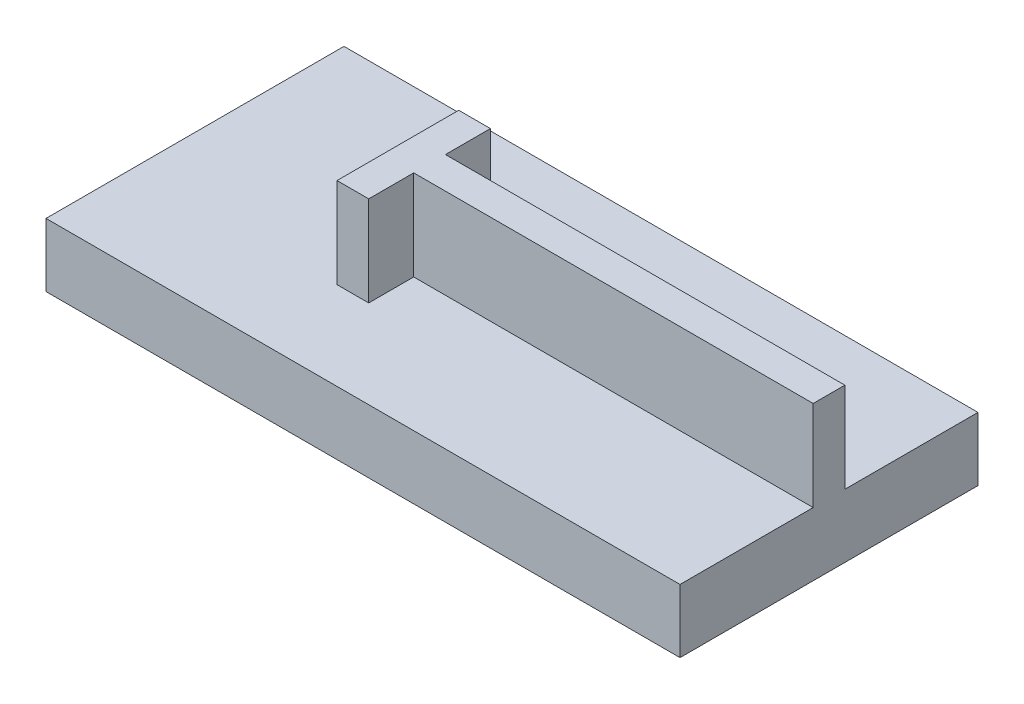
ISO-10303-21;
HEADER;
FILE_DESCRIPTION(('STEP AP214'),'2;1');
FILE_NAME('part.step','',(''),(''),'','','');
FILE_SCHEMA(('AUTOMOTIVE_DESIGN { 1 0 10303 214 1 1 1 1 }'));
ENDSEC;
DATA;
#1=APPLICATION_CONTEXT('core data for automotive mechanical design processes');
#2=APPLICATION_PROTOCOL_DEFINITION('international standard','automotive_design',2000,#1);
#3=PRODUCT_CONTEXT('',#1,'mechanical');
#4=PRODUCT('Part','Part','',(#3));
#5=PRODUCT_RELATED_PRODUCT_CATEGORY('part','',(#4));
#6=PRODUCT_DEFINITION_FORMATION('','',#4);
#7=PRODUCT_DEFINITION_CONTEXT('part definition',#1,'design');
#8=PRODUCT_DEFINITION('design','',#6,#7);
#9=PRODUCT_DEFINITION_SHAPE('','',#8);
#10=(LENGTH_UNIT() NAMED_UNIT(*) SI_UNIT(.MILLI.,.METRE.));
#11=(NAMED_UNIT(*) PLANE_ANGLE_UNIT() SI_UNIT($,.RADIAN.));
#12=(NAMED_UNIT(*) SI_UNIT($,.STERADIAN.) SOLID_ANGLE_UNIT());
#13=UNCERTAINTY_MEASURE_WITH_UNIT(LENGTH_MEASURE(1.E-05),#10,'distance_accuracy_value','');
#14=(GEOMETRIC_REPRESENTATION_CONTEXT(3) GLOBAL_UNCERTAINTY_ASSIGNED_CONTEXT((#13)) GLOBAL_UNIT_ASSIGNED_CONTEXT((#10,
#11,#12)) REPRESENTATION_CONTEXT('',''));
#15=CARTESIAN_POINT('',(0.,0.,0.));
#16=DIRECTION('',(0.,0.,1.));
#17=DIRECTION('',(1.,0.,0.));
#18=AXIS2_PLACEMENT_3D('',#15,#16,#17);
#19=CARTESIAN_POINT('',(0.,10.,0.));
#20=DIRECTION('',(0.,-1.,0.));
#21=DIRECTION('',(0.,0.,-1.));
#22=AXIS2_PLACEMENT_3D('',#19,#20,#21);
#23=PLANE('',#22);
#24=DIRECTION('',(-1.,0.,0.));
#25=VECTOR('',#24,1.);
#26=CARTESIAN_POINT('',(50.,10.,-2.5));
#27=LINE('',#26,#25);
#28=CARTESIAN_POINT('',(50.,10.,-2.5));
#29=VERTEX_POINT('',#28);
#30=CARTESIAN_POINT('',(-13.,10.,-2.49999999999999));
#31=VERTEX_POINT('',#30);
#32=EDGE_CURVE('E240',#29,#31,#27,.T.);
#33=ORIENTED_EDGE('',*,*,#32,.F.);
#34=DIRECTION('',(0.,0.,-1.));
#35=VECTOR('',#34,1.);
#36=CARTESIAN_POINT('',(50.,10.,23.5));
#37=LINE('',#36,#35);
#38=CARTESIAN_POINT('',(50.,10.,-23.5));
#39=VERTEX_POINT('',#38);
#40=EDGE_CURVE('E249',#29,#39,#37,.T.);
#41=ORIENTED_EDGE('',*,*,#40,.T.);
#42=DIRECTION('',(-1.,0.,0.));
#43=VECTOR('',#42,1.);
#44=CARTESIAN_POINT('',(-50.,10.,-23.5));
#45=LINE('',#44,#43);
#46=CARTESIAN_POINT('',(-50.,10.,-23.5));
#47=VERTEX_POINT('',#46);
#48=EDGE_CURVE('E245',#39,#47,#45,.T.);
#49=ORIENTED_EDGE('',*,*,#48,.T.);
#50=DIRECTION('',(0.,0.,1.));
#51=VECTOR('',#50,1.);
#52=CARTESIAN_POINT('',(-50.,10.,23.5));
#53=LINE('',#52,#51);
#54=CARTESIAN_POINT('',(-50.,10.,23.5));
#55=VERTEX_POINT('',#54);
#56=EDGE_CURVE('E271',#47,#55,#53,.T.);
#57=ORIENTED_EDGE('',*,*,#56,.T.);
#58=DIRECTION('',(1.,0.,0.));
#59=VECTOR('',#58,1.);
#60=CARTESIAN_POINT('',(-50.,10.,23.5));
#61=LINE('',#60,#59);
#62=CARTESIAN_POINT('',(50.,10.,23.5));
#63=VERTEX_POINT('',#62);
#64=EDGE_CURVE('E262',#55,#63,#61,.T.);
#65=ORIENTED_EDGE('',*,*,#64,.T.);
#66=CARTESIAN_POINT('',(50.,10.,2.5));
#67=VERTEX_POINT('',#66);
#68=EDGE_CURVE('E252',#63,#67,#37,.T.);
#69=ORIENTED_EDGE('',*,*,#68,.T.);
#70=DIRECTION('',(-1.,0.,0.));
#71=VECTOR('',#70,1.);
#72=CARTESIAN_POINT('',(50.,10.,2.5));
#73=LINE('',#72,#71);
#74=CARTESIAN_POINT('',(-13.,10.,2.50000000000001));
#75=VERTEX_POINT('',#74);
#76=EDGE_CURVE('E85',#67,#75,#73,.T.);
#77=ORIENTED_EDGE('',*,*,#76,.T.);
#78=DIRECTION('',(0.,0.,1.));
#79=VECTOR('',#78,1.);
#80=CARTESIAN_POINT('',(-13.,10.,0.));
#81=LINE('',#80,#79);
#82=CARTESIAN_POINT('',(-13.,10.,9.59999999999999));
#83=VERTEX_POINT('',#82);
#84=EDGE_CURVE('E180',#75,#83,#81,.T.);
#85=ORIENTED_EDGE('',*,*,#84,.T.);
#86=DIRECTION('',(-1.,0.,0.));
#87=VECTOR('',#86,1.);
#88=CARTESIAN_POINT('',(0.,10.,9.59999999999999));
#89=LINE('',#88,#87);
#90=CARTESIAN_POINT('',(-18.,10.,9.59999999999999));
#91=VERTEX_POINT('',#90);
#92=EDGE_CURVE('E176',#83,#91,#89,.T.);
#93=ORIENTED_EDGE('',*,*,#92,.T.);
#94=DIRECTION('',(0.,0.,1.));
#95=VECTOR('',#94,1.);
#96=CARTESIAN_POINT('',(-18.,10.,0.));
#97=LINE('',#96,#95);
#98=CARTESIAN_POINT('',(-18.,10.,-9.59999999999999));
#99=VERTEX_POINT('',#98);
#100=EDGE_CURVE('E203',#99,#91,#97,.T.);
#101=ORIENTED_EDGE('',*,*,#100,.F.);
#102=DIRECTION('',(-1.,0.,0.));
#103=VECTOR('',#102,1.);
#104=CARTESIAN_POINT('',(0.,10.,-9.59999999999999));
#105=LINE('',#104,#103);
#106=CARTESIAN_POINT('',(-13.,10.,-9.59999999999999));
#107=VERTEX_POINT('',#106);
#108=EDGE_CURVE('E193',#107,#99,#105,.T.);
#109=ORIENTED_EDGE('',*,*,#108,.F.);
#110=EDGE_CURVE('E78',#107,#31,#81,.T.);
#111=ORIENTED_EDGE('',*,*,#110,.T.);
#112=EDGE_LOOP('',(#33,#41,#49,#57,#65,#69,#77,#85,#93,#101,#109,#111));
#113=FACE_BOUND('',#112,.T.);
#114=ADVANCED_FACE('F61',(#113),#23,.F.);
#115=CARTESIAN_POINT('',(50.,10.,23.5));
#116=DIRECTION('',(-1.,0.,0.));
#117=DIRECTION('',(0.,0.,1.));
#118=AXIS2_PLACEMENT_3D('',#115,#116,#117);
#119=PLANE('',#118);
#120=DIRECTION('',(0.,0.,-1.));
#121=VECTOR('',#120,1.);
#122=CARTESIAN_POINT('',(50.,0.,23.5));
#123=LINE('',#122,#121);
#124=CARTESIAN_POINT('',(50.,0.,23.5));
#125=VERTEX_POINT('',#124);
#126=CARTESIAN_POINT('',(50.,0.,-23.5));
#127=VERTEX_POINT('',#126);
#128=EDGE_CURVE('E221',#125,#127,#123,.T.);
#129=ORIENTED_EDGE('',*,*,#128,.T.);
#130=DIRECTION('',(0.,-1.,0.));
#131=VECTOR('',#130,1.);
#132=CARTESIAN_POINT('',(50.,10.,-23.5));
#133=LINE('',#132,#131);
#134=EDGE_CURVE('E12',#39,#127,#133,.T.);
#135=ORIENTED_EDGE('',*,*,#134,.F.);
#136=ORIENTED_EDGE('',*,*,#40,.F.);
#137=DIRECTION('',(0.,-1.,0.));
#138=VECTOR('',#137,1.);
#139=CARTESIAN_POINT('',(50.,24.22,-2.5));
#140=LINE('',#139,#138);
#141=CARTESIAN_POINT('',(50.,24.22,-2.5));
#142=VERTEX_POINT('',#141);
#143=EDGE_CURVE('E230',#142,#29,#140,.T.);
#144=ORIENTED_EDGE('',*,*,#143,.F.);
#145=DIRECTION('',(0.,0.,1.));
#146=VECTOR('',#145,1.);
#147=CARTESIAN_POINT('',(50.,24.22,-2.5));
#148=LINE('',#147,#146);
#149=CARTESIAN_POINT('',(50.,24.22,2.5));
#150=VERTEX_POINT('',#149);
#151=EDGE_CURVE('E228',#142,#150,#148,.T.);
#152=ORIENTED_EDGE('',*,*,#151,.T.);
#153=DIRECTION('',(0.,-1.,0.));
#154=VECTOR('',#153,1.);
#155=CARTESIAN_POINT('',(50.,24.22,2.5));
#156=LINE('',#155,#154);
#157=EDGE_CURVE('E226',#150,#67,#156,.T.);
#158=ORIENTED_EDGE('',*,*,#157,.T.);
#159=ORIENTED_EDGE('',*,*,#68,.F.);
#160=DIRECTION('',(0.,-1.,0.));
#161=VECTOR('',#160,1.);
#162=CARTESIAN_POINT('',(50.,10.,23.5));
#163=LINE('',#162,#161);
#164=EDGE_CURVE('E259',#63,#125,#163,.T.);
#165=ORIENTED_EDGE('',*,*,#164,.T.);
#166=EDGE_LOOP('',(#129,#135,#136,#144,#152,#158,#159,#165));
#167=FACE_BOUND('',#166,.T.);
#168=ADVANCED_FACE('F63',(#167),#119,.F.);
#169=CARTESIAN_POINT('',(-50.,10.,-23.5));
#170=DIRECTION('',(0.,0.,1.));
#171=DIRECTION('',(1.,0.,0.));
#172=AXIS2_PLACEMENT_3D('',#169,#170,#171);
#173=PLANE('',#172);
#174=DIRECTION('',(-1.,0.,0.));
#175=VECTOR('',#174,1.);
#176=CARTESIAN_POINT('',(-50.,0.,-23.5));
#177=LINE('',#176,#175);
#178=CARTESIAN_POINT('',(-50.,0.,-23.5));
#179=VERTEX_POINT('',#178);
#180=EDGE_CURVE('E267',#127,#179,#177,.T.);
#181=ORIENTED_EDGE('',*,*,#180,.T.);
#182=DIRECTION('',(0.,-1.,0.));
#183=VECTOR('',#182,1.);
#184=CARTESIAN_POINT('',(-50.,10.,-23.5));
#185=LINE('',#184,#183);
#186=EDGE_CURVE('E70',#47,#179,#185,.T.);
#187=ORIENTED_EDGE('',*,*,#186,.F.);
#188=ORIENTED_EDGE('',*,*,#48,.F.);
#189=ORIENTED_EDGE('',*,*,#134,.T.);
#190=EDGE_LOOP('',(#181,#187,#188,#189));
#191=FACE_BOUND('',#190,.T.);
#192=ADVANCED_FACE('F279',(#191),#173,.F.);
#193=CARTESIAN_POINT('',(-50.,10.,23.5));
#194=DIRECTION('',(1.,0.,0.));
#195=DIRECTION('',(0.,0.,-1.));
#196=AXIS2_PLACEMENT_3D('',#193,#194,#195);
#197=PLANE('',#196);
#198=DIRECTION('',(0.,0.,1.));
#199=VECTOR('',#198,1.);
#200=CARTESIAN_POINT('',(-50.,0.,23.5));
#201=LINE('',#200,#199);
#202=CARTESIAN_POINT('',(-50.,0.,23.5));
#203=VERTEX_POINT('',#202);
#204=EDGE_CURVE('E265',#179,#203,#201,.T.);
#205=ORIENTED_EDGE('',*,*,#204,.T.);
#206=DIRECTION('',(0.,-1.,0.));
#207=VECTOR('',#206,1.);
#208=CARTESIAN_POINT('',(-50.,10.,23.5));
#209=LINE('',#208,#207);
#210=EDGE_CURVE('E256',#55,#203,#209,.T.);
#211=ORIENTED_EDGE('',*,*,#210,.F.);
#212=ORIENTED_EDGE('',*,*,#56,.F.);
#213=ORIENTED_EDGE('',*,*,#186,.T.);
#214=EDGE_LOOP('',(#205,#211,#212,#213));
#215=FACE_BOUND('',#214,.T.);
#216=ADVANCED_FACE('F282',(#215),#197,.F.);
#217=CARTESIAN_POINT('',(-50.,10.,23.5));
#218=DIRECTION('',(0.,0.,-1.));
#219=DIRECTION('',(-1.,0.,0.));
#220=AXIS2_PLACEMENT_3D('',#217,#218,#219);
#221=PLANE('',#220);
#222=DIRECTION('',(1.,0.,0.));
#223=VECTOR('',#222,1.);
#224=CARTESIAN_POINT('',(-50.,0.,23.5));
#225=LINE('',#224,#223);
#226=EDGE_CURVE('E263',#203,#125,#225,.T.);
#227=ORIENTED_EDGE('',*,*,#226,.T.);
#228=ORIENTED_EDGE('',*,*,#164,.F.);
#229=ORIENTED_EDGE('',*,*,#64,.F.);
#230=ORIENTED_EDGE('',*,*,#210,.T.);
#231=EDGE_LOOP('',(#227,#228,#229,#230));
#232=FACE_BOUND('',#231,.T.);
#233=ADVANCED_FACE('F287',(#232),#221,.F.);
#234=CARTESIAN_POINT('',(0.,0.,0.));
#235=DIRECTION('',(0.,-1.,0.));
#236=DIRECTION('',(0.,0.,-1.));
#237=AXIS2_PLACEMENT_3D('',#234,#235,#236);
#238=PLANE('',#237);
#239=ORIENTED_EDGE('',*,*,#128,.F.);
#240=ORIENTED_EDGE('',*,*,#226,.F.);
#241=ORIENTED_EDGE('',*,*,#204,.F.);
#242=ORIENTED_EDGE('',*,*,#180,.F.);
#243=EDGE_LOOP('',(#239,#240,#241,#242));
#244=FACE_BOUND('',#243,.T.);
#245=ADVANCED_FACE('F298',(#244),#238,.T.);
#246=CARTESIAN_POINT('',(-18.,24.22,0.));
#247=DIRECTION('',(1.,0.,0.));
#248=DIRECTION('',(0.,0.,-1.));
#249=AXIS2_PLACEMENT_3D('',#246,#247,#248);
#250=PLANE('',#249);
#251=ORIENTED_EDGE('',*,*,#100,.T.);
#252=DIRECTION('',(0.,-1.,0.));
#253=VECTOR('',#252,1.);
#254=CARTESIAN_POINT('',(-18.,24.22,9.59999999999999));
#255=LINE('',#254,#253);
#256=CARTESIAN_POINT('',(-18.,24.22,9.59999999999999));
#257=VERTEX_POINT('',#256);
#258=EDGE_CURVE('E198',#257,#91,#255,.T.);
#259=ORIENTED_EDGE('',*,*,#258,.F.);
#260=DIRECTION('',(0.,0.,1.));
#261=VECTOR('',#260,1.);
#262=CARTESIAN_POINT('',(-18.,24.22,0.));
#263=LINE('',#262,#261);
#264=CARTESIAN_POINT('',(-18.,24.22,-9.59999999999999));
#265=VERTEX_POINT('',#264);
#266=EDGE_CURVE('E167',#265,#257,#263,.T.);
#267=ORIENTED_EDGE('',*,*,#266,.F.);
#268=DIRECTION('',(0.,-1.,0.));
#269=VECTOR('',#268,1.);
#270=CARTESIAN_POINT('',(-18.,24.22,-9.59999999999999));
#271=LINE('',#270,#269);
#272=EDGE_CURVE('E159',#265,#99,#271,.T.);
#273=ORIENTED_EDGE('',*,*,#272,.T.);
#274=EDGE_LOOP('',(#251,#259,#267,#273));
#275=FACE_BOUND('',#274,.T.);
#276=ADVANCED_FACE('F207',(#275),#250,.F.);
#277=CARTESIAN_POINT('',(0.,24.22,9.59999999999999));
#278=DIRECTION('',(0.,0.,1.));
#279=DIRECTION('',(1.,0.,0.));
#280=AXIS2_PLACEMENT_3D('',#277,#278,#279);
#281=PLANE('',#280);
#282=ORIENTED_EDGE('',*,*,#92,.F.);
#283=DIRECTION('',(0.,-1.,0.));
#284=VECTOR('',#283,1.);
#285=CARTESIAN_POINT('',(-13.,24.22,9.59999999999999));
#286=LINE('',#285,#284);
#287=CARTESIAN_POINT('',(-13.,24.22,9.59999999999999));
#288=VERTEX_POINT('',#287);
#289=EDGE_CURVE('E190',#288,#83,#286,.T.);
#290=ORIENTED_EDGE('',*,*,#289,.F.);
#291=DIRECTION('',(-1.,0.,0.));
#292=VECTOR('',#291,1.);
#293=CARTESIAN_POINT('',(0.,24.22,9.59999999999999));
#294=LINE('',#293,#292);
#295=EDGE_CURVE('E188',#288,#257,#294,.T.);
#296=ORIENTED_EDGE('',*,*,#295,.T.);
#297=ORIENTED_EDGE('',*,*,#258,.T.);
#298=EDGE_LOOP('',(#282,#290,#296,#297));
#299=FACE_BOUND('',#298,.T.);
#300=ADVANCED_FACE('F214',(#299),#281,.T.);
#301=CARTESIAN_POINT('',(0.,24.22,-9.59999999999999));
#302=DIRECTION('',(0.,0.,1.));
#303=DIRECTION('',(1.,0.,0.));
#304=AXIS2_PLACEMENT_3D('',#301,#302,#303);
#305=PLANE('',#304);
#306=ORIENTED_EDGE('',*,*,#108,.T.);
#307=ORIENTED_EDGE('',*,*,#272,.F.);
#308=DIRECTION('',(-1.,0.,0.));
#309=VECTOR('',#308,1.);
#310=CARTESIAN_POINT('',(0.,24.22,-9.59999999999999));
#311=LINE('',#310,#309);
#312=CARTESIAN_POINT('',(-13.,24.22,-9.59999999999999));
#313=VERTEX_POINT('',#312);
#314=EDGE_CURVE('E162',#313,#265,#311,.T.);
#315=ORIENTED_EDGE('',*,*,#314,.F.);
#316=DIRECTION('',(0.,-1.,0.));
#317=VECTOR('',#316,1.);
#318=CARTESIAN_POINT('',(-13.,24.22,-9.59999999999999));
#319=LINE('',#318,#317);
#320=EDGE_CURVE('E151',#313,#107,#319,.T.);
#321=ORIENTED_EDGE('',*,*,#320,.T.);
#322=EDGE_LOOP('',(#306,#307,#315,#321));
#323=FACE_BOUND('',#322,.T.);
#324=ADVANCED_FACE('F163',(#323),#305,.F.);
#325=CARTESIAN_POINT('',(0.,24.22,0.));
#326=DIRECTION('',(0.,1.,0.));
#327=DIRECTION('',(0.,0.,1.));
#328=AXIS2_PLACEMENT_3D('',#325,#326,#327);
#329=PLANE('',#328);
#330=DIRECTION('',(0.,0.,1.));
#331=VECTOR('',#330,1.);
#332=CARTESIAN_POINT('',(-13.,24.22,0.));
#333=LINE('',#332,#331);
#334=CARTESIAN_POINT('',(-13.,24.22,-2.49999999999999));
#335=VERTEX_POINT('',#334);
#336=EDGE_CURVE('E155',#313,#335,#333,.T.);
#337=ORIENTED_EDGE('',*,*,#336,.F.);
#338=ORIENTED_EDGE('',*,*,#314,.T.);
#339=ORIENTED_EDGE('',*,*,#266,.T.);
#340=ORIENTED_EDGE('',*,*,#295,.F.);
#341=CARTESIAN_POINT('',(-13.,24.22,2.50000000000001));
#342=VERTEX_POINT('',#341);
#343=EDGE_CURVE('E174',#342,#288,#333,.T.);
#344=ORIENTED_EDGE('',*,*,#343,.F.);
#345=DIRECTION('',(-1.,0.,0.));
#346=VECTOR('',#345,1.);
#347=CARTESIAN_POINT('',(50.,24.22,2.5));
#348=LINE('',#347,#346);
#349=EDGE_CURVE('E223',#150,#342,#348,.T.);
#350=ORIENTED_EDGE('',*,*,#349,.F.);
#351=ORIENTED_EDGE('',*,*,#151,.F.);
#352=DIRECTION('',(-1.,0.,0.));
#353=VECTOR('',#352,1.);
#354=CARTESIAN_POINT('',(50.,24.22,-2.5));
#355=LINE('',#354,#353);
#356=EDGE_CURVE('E173',#142,#335,#355,.T.);
#357=ORIENTED_EDGE('',*,*,#356,.T.);
#358=EDGE_LOOP('',(#337,#338,#339,#340,#344,#350,#351,#357));
#359=FACE_BOUND('',#358,.T.);
#360=ADVANCED_FACE('F170',(#359),#329,.T.);
#361=CARTESIAN_POINT('',(-13.,24.22,0.));
#362=DIRECTION('',(1.,0.,0.));
#363=DIRECTION('',(0.,0.,-1.));
#364=AXIS2_PLACEMENT_3D('',#361,#362,#363);
#365=PLANE('',#364);
#366=ORIENTED_EDGE('',*,*,#336,.T.);
#367=DIRECTION('',(0.,-1.,0.));
#368=VECTOR('',#367,1.);
#369=CARTESIAN_POINT('',(-13.,24.22,-2.49999999999999));
#370=LINE('',#369,#368);
#371=EDGE_CURVE('E158',#335,#31,#370,.T.);
#372=ORIENTED_EDGE('',*,*,#371,.T.);
#373=ORIENTED_EDGE('',*,*,#110,.F.);
#374=ORIENTED_EDGE('',*,*,#320,.F.);
#375=EDGE_LOOP('',(#366,#372,#373,#374));
#376=FACE_BOUND('',#375,.T.);
#377=ADVANCED_FACE('F153',(#376),#365,.T.);
#378=DIRECTION('',(0.,-1.,0.));
#379=VECTOR('',#378,1.);
#380=CARTESIAN_POINT('',(-13.,24.22,2.50000000000001));
#381=LINE('',#380,#379);
#382=EDGE_CURVE('E218',#342,#75,#381,.T.);
#383=ORIENTED_EDGE('',*,*,#382,.F.);
#384=ORIENTED_EDGE('',*,*,#343,.T.);
#385=ORIENTED_EDGE('',*,*,#289,.T.);
#386=ORIENTED_EDGE('',*,*,#84,.F.);
#387=EDGE_LOOP('',(#383,#384,#385,#386));
#388=FACE_BOUND('',#387,.T.);
#389=ADVANCED_FACE('F217',(#388),#365,.T.);
#390=CARTESIAN_POINT('',(50.,24.22,-2.5));
#391=DIRECTION('',(0.,0.,1.));
#392=DIRECTION('',(1.,0.,0.));
#393=AXIS2_PLACEMENT_3D('',#390,#391,#392);
#394=PLANE('',#393);
#395=ORIENTED_EDGE('',*,*,#32,.T.);
#396=ORIENTED_EDGE('',*,*,#371,.F.);
#397=ORIENTED_EDGE('',*,*,#356,.F.);
#398=ORIENTED_EDGE('',*,*,#143,.T.);
#399=EDGE_LOOP('',(#395,#396,#397,#398));
#400=FACE_BOUND('',#399,.T.);
#401=ADVANCED_FACE('F295',(#400),#394,.F.);
#402=CARTESIAN_POINT('',(50.,24.22,2.5));
#403=DIRECTION('',(0.,0.,1.));
#404=DIRECTION('',(1.,0.,0.));
#405=AXIS2_PLACEMENT_3D('',#402,#403,#404);
#406=PLANE('',#405);
#407=ORIENTED_EDGE('',*,*,#76,.F.);
#408=ORIENTED_EDGE('',*,*,#157,.F.);
#409=ORIENTED_EDGE('',*,*,#349,.T.);
#410=ORIENTED_EDGE('',*,*,#382,.T.);
#411=EDGE_LOOP('',(#407,#408,#409,#410));
#412=FACE_BOUND('',#411,.T.);
#413=ADVANCED_FACE('F224',(#412),#406,.T.);
#414=CLOSED_SHELL('',(#114,#168,#192,#216,#233,#245,#276,#300,#324,#360,#377,#389,#401,#413));
#415=MANIFOLD_SOLID_BREP('B2',#414);
#416=ADVANCED_BREP_SHAPE_REPRESENTATION('',(#18,#415),#14);
#417=SHAPE_DEFINITION_REPRESENTATION(#9,#416);
ENDSEC;
END-ISO-10303-21;
